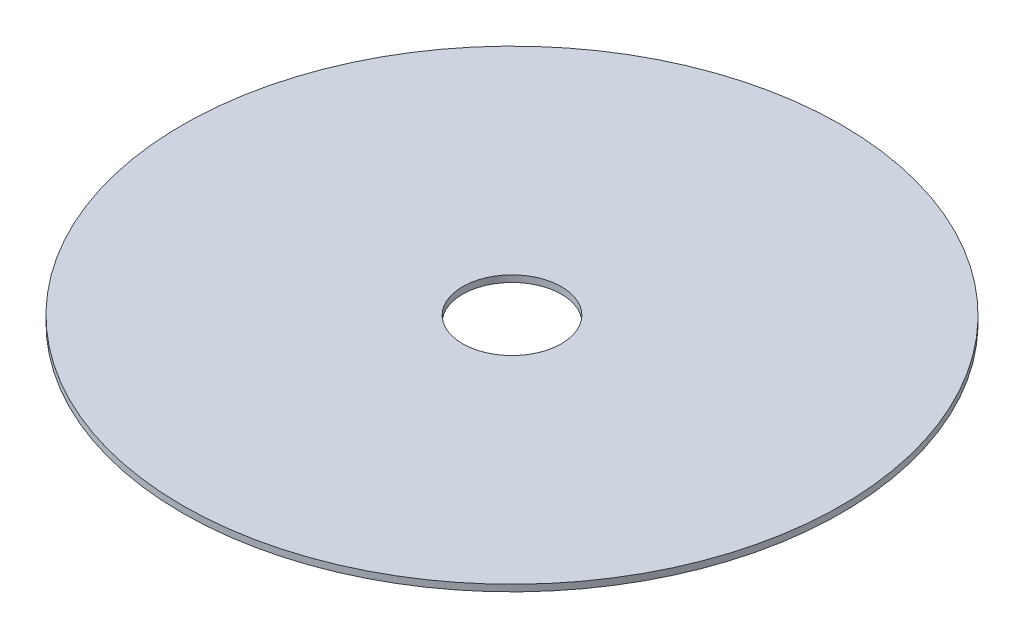
ISO-10303-21;
HEADER;
FILE_DESCRIPTION(('STEP AP214'),'2;1');
FILE_NAME('part.step','',(''),(''),'','','');
FILE_SCHEMA(('AUTOMOTIVE_DESIGN { 1 0 10303 214 1 1 1 1 }'));
ENDSEC;
DATA;
#1=APPLICATION_CONTEXT('core data for automotive mechanical design processes');
#2=APPLICATION_PROTOCOL_DEFINITION('international standard','automotive_design',2000,#1);
#3=PRODUCT_CONTEXT('',#1,'mechanical');
#4=PRODUCT('Part','Part','',(#3));
#5=PRODUCT_RELATED_PRODUCT_CATEGORY('part','',(#4));
#6=PRODUCT_DEFINITION_FORMATION('','',#4);
#7=PRODUCT_DEFINITION_CONTEXT('part definition',#1,'design');
#8=PRODUCT_DEFINITION('design','',#6,#7);
#9=PRODUCT_DEFINITION_SHAPE('','',#8);
#10=(LENGTH_UNIT() NAMED_UNIT(*) SI_UNIT(.MILLI.,.METRE.));
#11=(NAMED_UNIT(*) PLANE_ANGLE_UNIT() SI_UNIT($,.RADIAN.));
#12=(NAMED_UNIT(*) SI_UNIT($,.STERADIAN.) SOLID_ANGLE_UNIT());
#13=UNCERTAINTY_MEASURE_WITH_UNIT(LENGTH_MEASURE(1.E-05),#10,'distance_accuracy_value','');
#14=(GEOMETRIC_REPRESENTATION_CONTEXT(3) GLOBAL_UNCERTAINTY_ASSIGNED_CONTEXT((#13)) GLOBAL_UNIT_ASSIGNED_CONTEXT((#10,
#11,#12)) REPRESENTATION_CONTEXT('',''));
#15=CARTESIAN_POINT('',(0.,0.,0.));
#16=DIRECTION('',(0.,0.,1.));
#17=DIRECTION('',(1.,0.,0.));
#18=AXIS2_PLACEMENT_3D('',#15,#16,#17);
#19=CARTESIAN_POINT('',(0.,1.2,0.));
#20=DIRECTION('',(0.,1.,0.));
#21=DIRECTION('',(0.,0.,1.));
#22=AXIS2_PLACEMENT_3D('',#19,#20,#21);
#23=PLANE('',#22);
#24=CARTESIAN_POINT('',(0.,1.2,0.));
#25=DIRECTION('',(0.,1.,0.));
#26=DIRECTION('',(0.,0.,1.));
#27=AXIS2_PLACEMENT_3D('',#24,#25,#26);
#28=CIRCLE('',#27,60.);
#29=CARTESIAN_POINT('',(0.,1.2,60.));
#30=VERTEX_POINT('',#29);
#31=EDGE_CURVE('E10',#30,#30,#28,.T.);
#32=ORIENTED_EDGE('',*,*,#31,.T.);
#33=EDGE_LOOP('',(#32));
#34=FACE_BOUND('',#33,.T.);
#35=CARTESIAN_POINT('',(0.,1.2,0.));
#36=DIRECTION('',(0.,1.,0.));
#37=DIRECTION('',(0.,0.,1.));
#38=AXIS2_PLACEMENT_3D('',#35,#36,#37);
#39=CIRCLE('',#38,9.);
#40=CARTESIAN_POINT('',(0.,1.2,9.));
#41=VERTEX_POINT('',#40);
#42=EDGE_CURVE('E46',#41,#41,#39,.T.);
#43=ORIENTED_EDGE('',*,*,#42,.F.);
#44=EDGE_LOOP('',(#43));
#45=FACE_BOUND('',#44,.T.);
#46=ADVANCED_FACE('F35',(#34,#45),#23,.T.);
#47=CARTESIAN_POINT('',(0.,0.,0.));
#48=DIRECTION('',(0.,1.,0.));
#49=DIRECTION('',(0.,0.,1.));
#50=AXIS2_PLACEMENT_3D('',#47,#48,#49);
#51=PLANE('',#50);
#52=CARTESIAN_POINT('',(0.,0.,0.));
#53=DIRECTION('',(0.,1.,0.));
#54=DIRECTION('',(0.,0.,1.));
#55=AXIS2_PLACEMENT_3D('',#52,#53,#54);
#56=CIRCLE('',#55,60.);
#57=CARTESIAN_POINT('',(0.,0.,60.));
#58=VERTEX_POINT('',#57);
#59=EDGE_CURVE('E39',#58,#58,#56,.T.);
#60=ORIENTED_EDGE('',*,*,#59,.F.);
#61=EDGE_LOOP('',(#60));
#62=FACE_BOUND('',#61,.T.);
#63=CARTESIAN_POINT('',(0.,0.,0.));
#64=DIRECTION('',(0.,1.,0.));
#65=DIRECTION('',(0.,0.,1.));
#66=AXIS2_PLACEMENT_3D('',#63,#64,#65);
#67=CIRCLE('',#66,9.);
#68=CARTESIAN_POINT('',(0.,0.,9.));
#69=VERTEX_POINT('',#68);
#70=EDGE_CURVE('E48',#69,#69,#67,.T.);
#71=ORIENTED_EDGE('',*,*,#70,.T.);
#72=EDGE_LOOP('',(#71));
#73=FACE_BOUND('',#72,.T.);
#74=ADVANCED_FACE('F58',(#62,#73),#51,.F.);
#75=CARTESIAN_POINT('',(0.,1.2,0.));
#76=DIRECTION('',(0.,-1.,0.));
#77=DIRECTION('',(0.,0.,-1.));
#78=AXIS2_PLACEMENT_3D('',#75,#76,#77);
#79=CYLINDRICAL_SURFACE('',#78,60.);
#80=ORIENTED_EDGE('',*,*,#31,.F.);
#81=EDGE_LOOP('',(#80));
#82=FACE_BOUND('',#81,.T.);
#83=ORIENTED_EDGE('',*,*,#59,.T.);
#84=EDGE_LOOP('',(#83));
#85=FACE_BOUND('',#84,.T.);
#86=ADVANCED_FACE('F37',(#82,#85),#79,.T.);
#87=CARTESIAN_POINT('',(0.,1.2,0.));
#88=DIRECTION('',(0.,-1.,0.));
#89=DIRECTION('',(0.,0.,-1.));
#90=AXIS2_PLACEMENT_3D('',#87,#88,#89);
#91=CYLINDRICAL_SURFACE('',#90,9.);
#92=ORIENTED_EDGE('',*,*,#42,.T.);
#93=EDGE_LOOP('',(#92));
#94=FACE_BOUND('',#93,.T.);
#95=ORIENTED_EDGE('',*,*,#70,.F.);
#96=EDGE_LOOP('',(#95));
#97=FACE_BOUND('',#96,.T.);
#98=ADVANCED_FACE('F54',(#94,#97),#91,.F.);
#99=CLOSED_SHELL('',(#46,#74,#86,#98));
#100=MANIFOLD_SOLID_BREP('B2',#99);
#101=ADVANCED_BREP_SHAPE_REPRESENTATION('',(#18,#100),#14);
#102=SHAPE_DEFINITION_REPRESENTATION(#9,#101);
ENDSEC;
END-ISO-10303-21;
